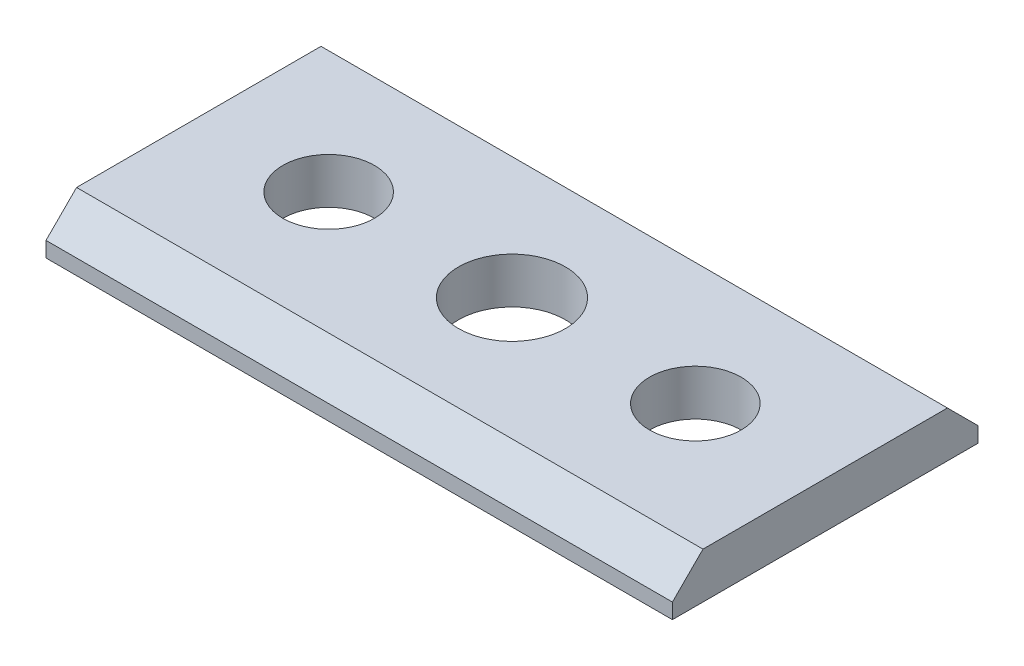
ISO-10303-21;
HEADER;
FILE_DESCRIPTION(('STEP AP214'),'2;1');
FILE_NAME('part.step','',(''),(''),'','','');
FILE_SCHEMA(('AUTOMOTIVE_DESIGN { 1 0 10303 214 1 1 1 1 }'));
ENDSEC;
DATA;
#1=APPLICATION_CONTEXT('core data for automotive mechanical design processes');
#2=APPLICATION_PROTOCOL_DEFINITION('international standard','automotive_design',2000,#1);
#3=PRODUCT_CONTEXT('',#1,'mechanical');
#4=PRODUCT('Part','Part','',(#3));
#5=PRODUCT_RELATED_PRODUCT_CATEGORY('part','',(#4));
#6=PRODUCT_DEFINITION_FORMATION('','',#4);
#7=PRODUCT_DEFINITION_CONTEXT('part definition',#1,'design');
#8=PRODUCT_DEFINITION('design','',#6,#7);
#9=PRODUCT_DEFINITION_SHAPE('','',#8);
#10=(LENGTH_UNIT() NAMED_UNIT(*) SI_UNIT(.MILLI.,.METRE.));
#11=(NAMED_UNIT(*) PLANE_ANGLE_UNIT() SI_UNIT($,.RADIAN.));
#12=(NAMED_UNIT(*) SI_UNIT($,.STERADIAN.) SOLID_ANGLE_UNIT());
#13=UNCERTAINTY_MEASURE_WITH_UNIT(LENGTH_MEASURE(1.E-05),#10,'distance_accuracy_value','');
#14=(GEOMETRIC_REPRESENTATION_CONTEXT(3) GLOBAL_UNCERTAINTY_ASSIGNED_CONTEXT((#13)) GLOBAL_UNIT_ASSIGNED_CONTEXT((#10,
#11,#12)) REPRESENTATION_CONTEXT('',''));
#15=CARTESIAN_POINT('',(0.,0.,0.));
#16=DIRECTION('',(0.,0.,1.));
#17=DIRECTION('',(1.,0.,0.));
#18=AXIS2_PLACEMENT_3D('',#15,#16,#17);
#19=CARTESIAN_POINT('',(41.,-3.,-20.));
#20=DIRECTION('',(0.,0.,-1.));
#21=DIRECTION('',(-1.,0.,0.));
#22=AXIS2_PLACEMENT_3D('',#19,#20,#21);
#23=PLANE('',#22);
#24=DIRECTION('',(0.,1.,0.));
#25=VECTOR('',#24,1.);
#26=CARTESIAN_POINT('',(0.,-3.,-20.));
#27=LINE('',#26,#25);
#28=CARTESIAN_POINT('',(0.,-3.,-20.));
#29=VERTEX_POINT('',#28);
#30=CARTESIAN_POINT('',(0.,-2.00000000000001,-20.));
#31=VERTEX_POINT('',#30);
#32=EDGE_CURVE('E85',#29,#31,#27,.T.);
#33=ORIENTED_EDGE('',*,*,#32,.T.);
#34=DIRECTION('',(1.,0.,0.));
#35=VECTOR('',#34,1.);
#36=CARTESIAN_POINT('',(41.,-2.00000000000001,-20.));
#37=LINE('',#36,#35);
#38=CARTESIAN_POINT('',(41.,-2.00000000000001,-20.));
#39=VERTEX_POINT('',#38);
#40=EDGE_CURVE('E56',#31,#39,#37,.T.);
#41=ORIENTED_EDGE('',*,*,#40,.T.);
#42=DIRECTION('',(0.,1.,0.));
#43=VECTOR('',#42,1.);
#44=CARTESIAN_POINT('',(41.,-3.,-20.));
#45=LINE('',#44,#43);
#46=CARTESIAN_POINT('',(41.,-3.,-20.));
#47=VERTEX_POINT('',#46);
#48=EDGE_CURVE('E106',#47,#39,#45,.T.);
#49=ORIENTED_EDGE('',*,*,#48,.F.);
#50=DIRECTION('',(-1.,0.,0.));
#51=VECTOR('',#50,1.);
#52=CARTESIAN_POINT('',(41.,-3.,-20.));
#53=LINE('',#52,#51);
#54=EDGE_CURVE('E101',#47,#29,#53,.T.);
#55=ORIENTED_EDGE('',*,*,#54,.T.);
#56=EDGE_LOOP('',(#33,#41,#49,#55));
#57=FACE_BOUND('',#56,.T.);
#58=ADVANCED_FACE('F33',(#57),#23,.T.);
#59=CARTESIAN_POINT('',(41.,-3.,0.));
#60=DIRECTION('',(1.,0.,0.));
#61=DIRECTION('',(0.,0.,-1.));
#62=AXIS2_PLACEMENT_3D('',#59,#60,#61);
#63=PLANE('',#62);
#64=ORIENTED_EDGE('',*,*,#48,.T.);
#65=DIRECTION('',(0.,-0.707106781186549,-0.707106781186546));
#66=VECTOR('',#65,1.);
#67=CARTESIAN_POINT('',(41.,7.5,-10.5));
#68=LINE('',#67,#66);
#69=CARTESIAN_POINT('',(41.,0.,-18.));
#70=VERTEX_POINT('',#69);
#71=EDGE_CURVE('E41',#39,#70,#68,.F.);
#72=ORIENTED_EDGE('',*,*,#71,.T.);
#73=DIRECTION('',(0.,0.,-1.));
#74=VECTOR('',#73,1.);
#75=CARTESIAN_POINT('',(41.,0.,0.));
#76=LINE('',#75,#74);
#77=CARTESIAN_POINT('',(41.,0.,-2.));
#78=VERTEX_POINT('',#77);
#79=EDGE_CURVE('E107',#78,#70,#76,.T.);
#80=ORIENTED_EDGE('',*,*,#79,.F.);
#81=DIRECTION('',(0.,0.707106781186549,-0.707106781186546));
#82=VECTOR('',#81,1.);
#83=CARTESIAN_POINT('',(41.,-2.50000000000001,0.499999999999996));
#84=LINE('',#83,#82);
#85=CARTESIAN_POINT('',(41.,-2.00000000000001,0.));
#86=VERTEX_POINT('',#85);
#87=EDGE_CURVE('E48',#78,#86,#84,.F.);
#88=ORIENTED_EDGE('',*,*,#87,.T.);
#89=DIRECTION('',(0.,1.,0.));
#90=VECTOR('',#89,1.);
#91=CARTESIAN_POINT('',(41.,-3.,0.));
#92=LINE('',#91,#90);
#93=CARTESIAN_POINT('',(41.,-3.,0.));
#94=VERTEX_POINT('',#93);
#95=EDGE_CURVE('E123',#94,#86,#92,.T.);
#96=ORIENTED_EDGE('',*,*,#95,.F.);
#97=DIRECTION('',(0.,0.,-1.));
#98=VECTOR('',#97,1.);
#99=CARTESIAN_POINT('',(41.,-3.,0.));
#100=LINE('',#99,#98);
#101=EDGE_CURVE('E94',#94,#47,#100,.T.);
#102=ORIENTED_EDGE('',*,*,#101,.T.);
#103=EDGE_LOOP('',(#64,#72,#80,#88,#96,#102));
#104=FACE_BOUND('',#103,.T.);
#105=ADVANCED_FACE('F136',(#104),#63,.T.);
#106=CARTESIAN_POINT('',(0.,-3.,0.));
#107=DIRECTION('',(0.,0.,1.));
#108=DIRECTION('',(1.,0.,0.));
#109=AXIS2_PLACEMENT_3D('',#106,#107,#108);
#110=PLANE('',#109);
#111=ORIENTED_EDGE('',*,*,#95,.T.);
#112=DIRECTION('',(-1.,0.,0.));
#113=VECTOR('',#112,1.);
#114=CARTESIAN_POINT('',(0.,-2.00000000000001,0.));
#115=LINE('',#114,#113);
#116=CARTESIAN_POINT('',(0.,-2.00000000000001,0.));
#117=VERTEX_POINT('',#116);
#118=EDGE_CURVE('E11',#86,#117,#115,.T.);
#119=ORIENTED_EDGE('',*,*,#118,.T.);
#120=DIRECTION('',(0.,1.,0.));
#121=VECTOR('',#120,1.);
#122=CARTESIAN_POINT('',(0.,-3.,0.));
#123=LINE('',#122,#121);
#124=CARTESIAN_POINT('',(0.,-3.,0.));
#125=VERTEX_POINT('',#124);
#126=EDGE_CURVE('E93',#125,#117,#123,.T.);
#127=ORIENTED_EDGE('',*,*,#126,.F.);
#128=DIRECTION('',(1.,0.,0.));
#129=VECTOR('',#128,1.);
#130=CARTESIAN_POINT('',(0.,-3.,0.));
#131=LINE('',#130,#129);
#132=EDGE_CURVE('E104',#125,#94,#131,.T.);
#133=ORIENTED_EDGE('',*,*,#132,.T.);
#134=EDGE_LOOP('',(#111,#119,#127,#133));
#135=FACE_BOUND('',#134,.T.);
#136=ADVANCED_FACE('F158',(#135),#110,.T.);
#137=CARTESIAN_POINT('',(0.,-3.,-20.));
#138=DIRECTION('',(-1.,0.,0.));
#139=DIRECTION('',(0.,0.,1.));
#140=AXIS2_PLACEMENT_3D('',#137,#138,#139);
#141=PLANE('',#140);
#142=DIRECTION('',(0.,0.,1.));
#143=VECTOR('',#142,1.);
#144=CARTESIAN_POINT('',(0.,0.,-20.));
#145=LINE('',#144,#143);
#146=CARTESIAN_POINT('',(0.,0.,-18.));
#147=VERTEX_POINT('',#146);
#148=CARTESIAN_POINT('',(0.,0.,-2.));
#149=VERTEX_POINT('',#148);
#150=EDGE_CURVE('E110',#147,#149,#145,.T.);
#151=ORIENTED_EDGE('',*,*,#150,.F.);
#152=DIRECTION('',(0.,0.707106781186549,0.707106781186546));
#153=VECTOR('',#152,1.);
#154=CARTESIAN_POINT('',(0.,-2.50000000000001,-20.5));
#155=LINE('',#154,#153);
#156=EDGE_CURVE('E91',#147,#31,#155,.F.);
#157=ORIENTED_EDGE('',*,*,#156,.T.);
#158=ORIENTED_EDGE('',*,*,#32,.F.);
#159=DIRECTION('',(0.,0.,1.));
#160=VECTOR('',#159,1.);
#161=CARTESIAN_POINT('',(0.,-3.,-20.));
#162=LINE('',#161,#160);
#163=EDGE_CURVE('E90',#29,#125,#162,.T.);
#164=ORIENTED_EDGE('',*,*,#163,.T.);
#165=ORIENTED_EDGE('',*,*,#126,.T.);
#166=DIRECTION('',(0.,-0.707106781186549,0.707106781186546));
#167=VECTOR('',#166,1.);
#168=CARTESIAN_POINT('',(0.,7.49999999999999,-9.49999999999996));
#169=LINE('',#168,#167);
#170=EDGE_CURVE('E131',#117,#149,#169,.F.);
#171=ORIENTED_EDGE('',*,*,#170,.T.);
#172=EDGE_LOOP('',(#151,#157,#158,#164,#165,#171));
#173=FACE_BOUND('',#172,.T.);
#174=ADVANCED_FACE('F88',(#173),#141,.T.);
#175=CARTESIAN_POINT('',(0.,-3.,0.));
#176=DIRECTION('',(0.,1.,0.));
#177=DIRECTION('',(0.,0.,1.));
#178=AXIS2_PLACEMENT_3D('',#175,#176,#177);
#179=PLANE('',#178);
#180=CARTESIAN_POINT('',(20.5,-3.,-10.));
#181=DIRECTION('',(0.,1.,0.));
#182=DIRECTION('',(0.,0.,1.));
#183=AXIS2_PLACEMENT_3D('',#180,#181,#182);
#184=CIRCLE('',#183,3.5);
#185=CARTESIAN_POINT('',(20.5,-3.,-6.5));
#186=VERTEX_POINT('',#185);
#187=EDGE_CURVE('E188',#186,#186,#184,.T.);
#188=ORIENTED_EDGE('',*,*,#187,.T.);
#189=EDGE_LOOP('',(#188));
#190=FACE_BOUND('',#189,.T.);
#191=CARTESIAN_POINT('',(32.5,-3.,-10.));
#192=DIRECTION('',(0.,1.,0.));
#193=DIRECTION('',(0.,0.,1.));
#194=AXIS2_PLACEMENT_3D('',#191,#192,#193);
#195=CIRCLE('',#194,3.);
#196=CARTESIAN_POINT('',(32.5,-3.,-7.));
#197=VERTEX_POINT('',#196);
#198=EDGE_CURVE('E183',#197,#197,#195,.T.);
#199=ORIENTED_EDGE('',*,*,#198,.T.);
#200=EDGE_LOOP('',(#199));
#201=FACE_BOUND('',#200,.T.);
#202=CARTESIAN_POINT('',(8.50000000000001,-3.,-10.));
#203=DIRECTION('',(0.,1.,0.));
#204=DIRECTION('',(0.,0.,1.));
#205=AXIS2_PLACEMENT_3D('',#202,#203,#204);
#206=CIRCLE('',#205,3.);
#207=CARTESIAN_POINT('',(8.50000000000001,-3.,-7.));
#208=VERTEX_POINT('',#207);
#209=EDGE_CURVE('E119',#208,#208,#206,.T.);
#210=ORIENTED_EDGE('',*,*,#209,.T.);
#211=EDGE_LOOP('',(#210));
#212=FACE_BOUND('',#211,.T.);
#213=ORIENTED_EDGE('',*,*,#54,.F.);
#214=ORIENTED_EDGE('',*,*,#101,.F.);
#215=ORIENTED_EDGE('',*,*,#132,.F.);
#216=ORIENTED_EDGE('',*,*,#163,.F.);
#217=EDGE_LOOP('',(#213,#214,#215,#216));
#218=FACE_BOUND('',#217,.T.);
#219=ADVANCED_FACE('F99',(#190,#201,#212,#218),#179,.F.);
#220=CARTESIAN_POINT('',(0.,0.,0.));
#221=DIRECTION('',(0.,1.,0.));
#222=DIRECTION('',(0.,0.,1.));
#223=AXIS2_PLACEMENT_3D('',#220,#221,#222);
#224=PLANE('',#223);
#225=CARTESIAN_POINT('',(20.5,0.,-10.));
#226=DIRECTION('',(0.,1.,0.));
#227=DIRECTION('',(0.,0.,1.));
#228=AXIS2_PLACEMENT_3D('',#225,#226,#227);
#229=CIRCLE('',#228,3.5);
#230=CARTESIAN_POINT('',(20.5,0.,-6.5));
#231=VERTEX_POINT('',#230);
#232=EDGE_CURVE('E192',#231,#231,#229,.T.);
#233=ORIENTED_EDGE('',*,*,#232,.F.);
#234=EDGE_LOOP('',(#233));
#235=FACE_BOUND('',#234,.T.);
#236=CARTESIAN_POINT('',(32.5,0.,-10.));
#237=DIRECTION('',(0.,1.,0.));
#238=DIRECTION('',(0.,0.,1.));
#239=AXIS2_PLACEMENT_3D('',#236,#237,#238);
#240=CIRCLE('',#239,3.);
#241=CARTESIAN_POINT('',(32.5,0.,-7.));
#242=VERTEX_POINT('',#241);
#243=EDGE_CURVE('E186',#242,#242,#240,.T.);
#244=ORIENTED_EDGE('',*,*,#243,.F.);
#245=EDGE_LOOP('',(#244));
#246=FACE_BOUND('',#245,.T.);
#247=CARTESIAN_POINT('',(8.50000000000001,0.,-10.));
#248=DIRECTION('',(0.,1.,0.));
#249=DIRECTION('',(0.,0.,1.));
#250=AXIS2_PLACEMENT_3D('',#247,#248,#249);
#251=CIRCLE('',#250,3.);
#252=CARTESIAN_POINT('',(8.50000000000001,0.,-7.));
#253=VERTEX_POINT('',#252);
#254=EDGE_CURVE('E113',#253,#253,#251,.T.);
#255=ORIENTED_EDGE('',*,*,#254,.F.);
#256=EDGE_LOOP('',(#255));
#257=FACE_BOUND('',#256,.T.);
#258=ORIENTED_EDGE('',*,*,#79,.T.);
#259=DIRECTION('',(-1.,0.,0.));
#260=VECTOR('',#259,1.);
#261=CARTESIAN_POINT('',(0.,0.,-18.));
#262=LINE('',#261,#260);
#263=EDGE_CURVE('E128',#70,#147,#262,.T.);
#264=ORIENTED_EDGE('',*,*,#263,.T.);
#265=ORIENTED_EDGE('',*,*,#150,.T.);
#266=DIRECTION('',(1.,0.,0.));
#267=VECTOR('',#266,1.);
#268=CARTESIAN_POINT('',(0.,0.,-2.));
#269=LINE('',#268,#267);
#270=EDGE_CURVE('E122',#149,#78,#269,.T.);
#271=ORIENTED_EDGE('',*,*,#270,.T.);
#272=EDGE_LOOP('',(#258,#264,#265,#271));
#273=FACE_BOUND('',#272,.T.);
#274=ADVANCED_FACE('F140',(#235,#246,#257,#273),#224,.T.);
#275=CARTESIAN_POINT('',(8.50000000000001,-3.,-10.));
#276=DIRECTION('',(0.,1.,0.));
#277=DIRECTION('',(0.,0.,1.));
#278=AXIS2_PLACEMENT_3D('',#275,#276,#277);
#279=CYLINDRICAL_SURFACE('',#278,3.);
#280=ORIENTED_EDGE('',*,*,#209,.F.);
#281=EDGE_LOOP('',(#280));
#282=FACE_BOUND('',#281,.T.);
#283=ORIENTED_EDGE('',*,*,#254,.T.);
#284=EDGE_LOOP('',(#283));
#285=FACE_BOUND('',#284,.T.);
#286=ADVANCED_FACE('F168',(#282,#285),#279,.F.);
#287=CARTESIAN_POINT('',(32.5,-3.,-10.));
#288=DIRECTION('',(0.,1.,0.));
#289=DIRECTION('',(0.,0.,1.));
#290=AXIS2_PLACEMENT_3D('',#287,#288,#289);
#291=CYLINDRICAL_SURFACE('',#290,3.);
#292=ORIENTED_EDGE('',*,*,#198,.F.);
#293=EDGE_LOOP('',(#292));
#294=FACE_BOUND('',#293,.T.);
#295=ORIENTED_EDGE('',*,*,#243,.T.);
#296=EDGE_LOOP('',(#295));
#297=FACE_BOUND('',#296,.T.);
#298=ADVANCED_FACE('F150',(#294,#297),#291,.F.);
#299=CARTESIAN_POINT('',(20.5,-3.,-10.));
#300=DIRECTION('',(0.,1.,0.));
#301=DIRECTION('',(0.,0.,1.));
#302=AXIS2_PLACEMENT_3D('',#299,#300,#301);
#303=CYLINDRICAL_SURFACE('',#302,3.5);
#304=ORIENTED_EDGE('',*,*,#187,.F.);
#305=EDGE_LOOP('',(#304));
#306=FACE_BOUND('',#305,.T.);
#307=ORIENTED_EDGE('',*,*,#232,.T.);
#308=EDGE_LOOP('',(#307));
#309=FACE_BOUND('',#308,.T.);
#310=ADVANCED_FACE('F144',(#306,#309),#303,.F.);
#311=CARTESIAN_POINT('',(0.,0.,-18.));
#312=DIRECTION('',(0.,-0.707106781186546,0.707106781186549));
#313=DIRECTION('',(-1.,0.,0.));
#314=AXIS2_PLACEMENT_3D('',#311,#312,#313);
#315=PLANE('',#314);
#316=ORIENTED_EDGE('',*,*,#71,.F.);
#317=ORIENTED_EDGE('',*,*,#40,.F.);
#318=ORIENTED_EDGE('',*,*,#156,.F.);
#319=ORIENTED_EDGE('',*,*,#263,.F.);
#320=EDGE_LOOP('',(#316,#317,#318,#319));
#321=FACE_BOUND('',#320,.T.);
#322=ADVANCED_FACE('F142',(#321),#315,.F.);
#323=CARTESIAN_POINT('',(0.,0.,-2.));
#324=DIRECTION('',(0.,-0.707106781186546,-0.707106781186549));
#325=DIRECTION('',(1.,0.,0.));
#326=AXIS2_PLACEMENT_3D('',#323,#324,#325);
#327=PLANE('',#326);
#328=ORIENTED_EDGE('',*,*,#170,.F.);
#329=ORIENTED_EDGE('',*,*,#118,.F.);
#330=ORIENTED_EDGE('',*,*,#87,.F.);
#331=ORIENTED_EDGE('',*,*,#270,.F.);
#332=EDGE_LOOP('',(#328,#329,#330,#331));
#333=FACE_BOUND('',#332,.T.);
#334=ADVANCED_FACE('F35',(#333),#327,.F.);
#335=CLOSED_SHELL('',(#58,#105,#136,#174,#219,#274,#286,#298,#310,#322,#334));
#336=MANIFOLD_SOLID_BREP('B2',#335);
#337=ADVANCED_BREP_SHAPE_REPRESENTATION('',(#18,#336),#14);
#338=SHAPE_DEFINITION_REPRESENTATION(#9,#337);
ENDSEC;
END-ISO-10303-21;
